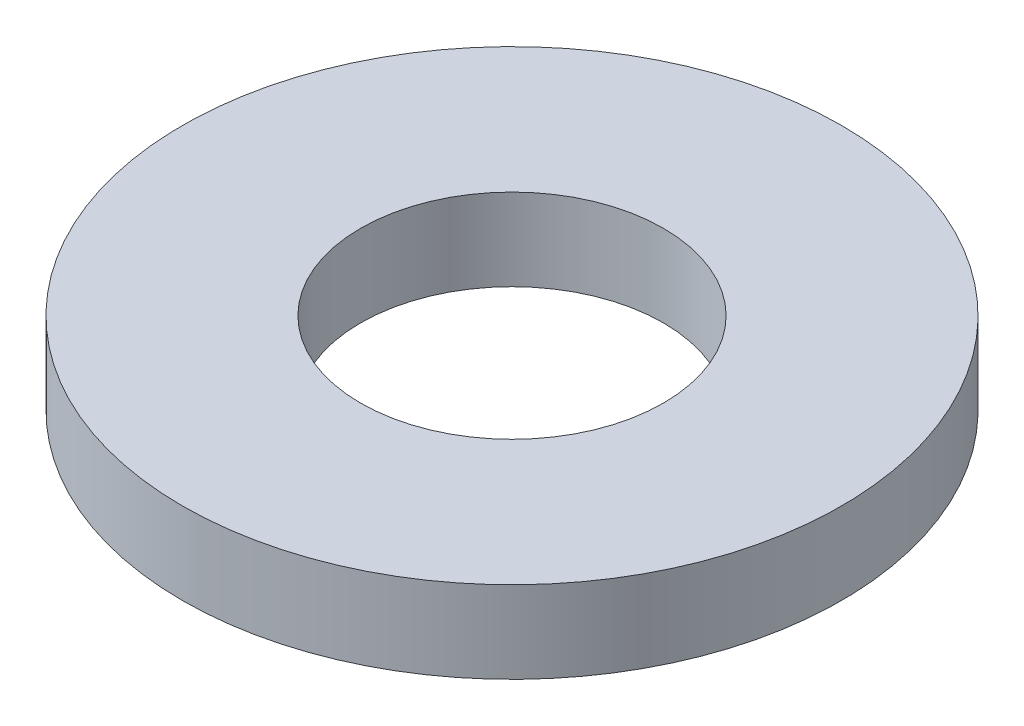
ISO-10303-21;
HEADER;
FILE_DESCRIPTION(('STEP AP214'),'2;1');
FILE_NAME('part.step','',(''),(''),'','','');
FILE_SCHEMA(('AUTOMOTIVE_DESIGN { 1 0 10303 214 1 1 1 1 }'));
ENDSEC;
DATA;
#1=APPLICATION_CONTEXT('core data for automotive mechanical design processes');
#2=APPLICATION_PROTOCOL_DEFINITION('international standard','automotive_design',2000,#1);
#3=PRODUCT_CONTEXT('',#1,'mechanical');
#4=PRODUCT('Part','Part','',(#3));
#5=PRODUCT_RELATED_PRODUCT_CATEGORY('part','',(#4));
#6=PRODUCT_DEFINITION_FORMATION('','',#4);
#7=PRODUCT_DEFINITION_CONTEXT('part definition',#1,'design');
#8=PRODUCT_DEFINITION('design','',#6,#7);
#9=PRODUCT_DEFINITION_SHAPE('','',#8);
#10=(LENGTH_UNIT() NAMED_UNIT(*) SI_UNIT(.MILLI.,.METRE.));
#11=(NAMED_UNIT(*) PLANE_ANGLE_UNIT() SI_UNIT($,.RADIAN.));
#12=(NAMED_UNIT(*) SI_UNIT($,.STERADIAN.) SOLID_ANGLE_UNIT());
#13=UNCERTAINTY_MEASURE_WITH_UNIT(LENGTH_MEASURE(1.E-05),#10,'distance_accuracy_value','');
#14=(GEOMETRIC_REPRESENTATION_CONTEXT(3) GLOBAL_UNCERTAINTY_ASSIGNED_CONTEXT((#13)) GLOBAL_UNIT_ASSIGNED_CONTEXT((#10,
#11,#12)) REPRESENTATION_CONTEXT('',''));
#15=CARTESIAN_POINT('',(0.,0.,0.));
#16=DIRECTION('',(0.,0.,1.));
#17=DIRECTION('',(1.,0.,0.));
#18=AXIS2_PLACEMENT_3D('',#15,#16,#17);
#19=CARTESIAN_POINT('',(0.,23.,0.));
#20=DIRECTION('',(0.,-1.,0.));
#21=DIRECTION('',(0.,0.,-1.));
#22=AXIS2_PLACEMENT_3D('',#19,#20,#21);
#23=CYLINDRICAL_SURFACE('',#22,92.5);
#24=CARTESIAN_POINT('',(0.,23.,0.));
#25=DIRECTION('',(0.,1.,0.));
#26=DIRECTION('',(0.,0.,1.));
#27=AXIS2_PLACEMENT_3D('',#24,#25,#26);
#28=CIRCLE('',#27,92.5);
#29=CARTESIAN_POINT('',(0.,23.,92.5));
#30=VERTEX_POINT('',#29);
#31=EDGE_CURVE('E10',#30,#30,#28,.T.);
#32=ORIENTED_EDGE('',*,*,#31,.F.);
#33=EDGE_LOOP('',(#32));
#34=FACE_BOUND('',#33,.T.);
#35=CARTESIAN_POINT('',(0.,0.,0.));
#36=DIRECTION('',(0.,1.,0.));
#37=DIRECTION('',(0.,0.,1.));
#38=AXIS2_PLACEMENT_3D('',#35,#36,#37);
#39=CIRCLE('',#38,92.5);
#40=CARTESIAN_POINT('',(0.,0.,92.5));
#41=VERTEX_POINT('',#40);
#42=EDGE_CURVE('E37',#41,#41,#39,.T.);
#43=ORIENTED_EDGE('',*,*,#42,.T.);
#44=EDGE_LOOP('',(#43));
#45=FACE_BOUND('',#44,.T.);
#46=ADVANCED_FACE('F40',(#34,#45),#23,.T.);
#47=CARTESIAN_POINT('',(0.,23.,0.));
#48=DIRECTION('',(0.,1.,0.));
#49=DIRECTION('',(0.,0.,1.));
#50=AXIS2_PLACEMENT_3D('',#47,#48,#49);
#51=PLANE('',#50);
#52=CARTESIAN_POINT('',(0.,23.,0.));
#53=DIRECTION('',(0.,1.,0.));
#54=DIRECTION('',(0.,0.,1.));
#55=AXIS2_PLACEMENT_3D('',#52,#53,#54);
#56=CIRCLE('',#55,42.5);
#57=CARTESIAN_POINT('',(0.,23.,42.5));
#58=VERTEX_POINT('',#57);
#59=EDGE_CURVE('E50',#58,#58,#56,.T.);
#60=ORIENTED_EDGE('',*,*,#59,.F.);
#61=EDGE_LOOP('',(#60));
#62=FACE_BOUND('',#61,.T.);
#63=ORIENTED_EDGE('',*,*,#31,.T.);
#64=EDGE_LOOP('',(#63));
#65=FACE_BOUND('',#64,.T.);
#66=ADVANCED_FACE('F59',(#62,#65),#51,.T.);
#67=CARTESIAN_POINT('',(0.,0.,0.));
#68=DIRECTION('',(0.,1.,0.));
#69=DIRECTION('',(0.,0.,1.));
#70=AXIS2_PLACEMENT_3D('',#67,#68,#69);
#71=PLANE('',#70);
#72=CARTESIAN_POINT('',(0.,0.,0.));
#73=DIRECTION('',(0.,1.,0.));
#74=DIRECTION('',(0.,0.,1.));
#75=AXIS2_PLACEMENT_3D('',#72,#73,#74);
#76=CIRCLE('',#75,42.5);
#77=CARTESIAN_POINT('',(0.,0.,42.5));
#78=VERTEX_POINT('',#77);
#79=EDGE_CURVE('E47',#78,#78,#76,.T.);
#80=ORIENTED_EDGE('',*,*,#79,.T.);
#81=EDGE_LOOP('',(#80));
#82=FACE_BOUND('',#81,.T.);
#83=ORIENTED_EDGE('',*,*,#42,.F.);
#84=EDGE_LOOP('',(#83));
#85=FACE_BOUND('',#84,.T.);
#86=ADVANCED_FACE('F58',(#82,#85),#71,.F.);
#87=CARTESIAN_POINT('',(0.,23.,0.));
#88=DIRECTION('',(0.,-1.,0.));
#89=DIRECTION('',(0.,0.,-1.));
#90=AXIS2_PLACEMENT_3D('',#87,#88,#89);
#91=CYLINDRICAL_SURFACE('',#90,42.5);
#92=ORIENTED_EDGE('',*,*,#59,.T.);
#93=EDGE_LOOP('',(#92));
#94=FACE_BOUND('',#93,.T.);
#95=ORIENTED_EDGE('',*,*,#79,.F.);
#96=EDGE_LOOP('',(#95));
#97=FACE_BOUND('',#96,.T.);
#98=ADVANCED_FACE('F54',(#94,#97),#91,.F.);
#99=CLOSED_SHELL('',(#46,#66,#86,#98));
#100=MANIFOLD_SOLID_BREP('B2',#99);
#101=ADVANCED_BREP_SHAPE_REPRESENTATION('',(#18,#100),#14);
#102=SHAPE_DEFINITION_REPRESENTATION(#9,#101);
ENDSEC;
END-ISO-10303-21;
